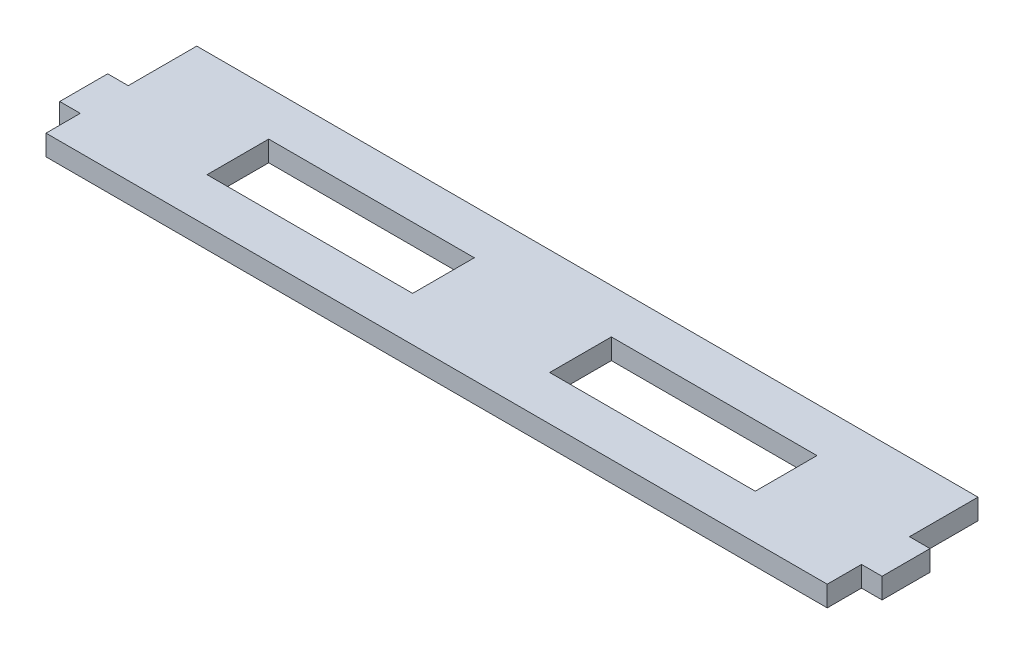
ISO-10303-21;
HEADER;
FILE_DESCRIPTION(('STEP AP214'),'2;1');
FILE_NAME('part.step','',(''),(''),'','','');
FILE_SCHEMA(('AUTOMOTIVE_DESIGN { 1 0 10303 214 1 1 1 1 }'));
ENDSEC;
DATA;
#1=APPLICATION_CONTEXT('core data for automotive mechanical design processes');
#2=APPLICATION_PROTOCOL_DEFINITION('international standard','automotive_design',2000,#1);
#3=PRODUCT_CONTEXT('',#1,'mechanical');
#4=PRODUCT('Part','Part','',(#3));
#5=PRODUCT_RELATED_PRODUCT_CATEGORY('part','',(#4));
#6=PRODUCT_DEFINITION_FORMATION('','',#4);
#7=PRODUCT_DEFINITION_CONTEXT('part definition',#1,'design');
#8=PRODUCT_DEFINITION('design','',#6,#7);
#9=PRODUCT_DEFINITION_SHAPE('','',#8);
#10=(LENGTH_UNIT() NAMED_UNIT(*) SI_UNIT(.MILLI.,.METRE.));
#11=(NAMED_UNIT(*) PLANE_ANGLE_UNIT() SI_UNIT($,.RADIAN.));
#12=(NAMED_UNIT(*) SI_UNIT($,.STERADIAN.) SOLID_ANGLE_UNIT());
#13=UNCERTAINTY_MEASURE_WITH_UNIT(LENGTH_MEASURE(1.E-05),#10,'distance_accuracy_value','');
#14=(GEOMETRIC_REPRESENTATION_CONTEXT(3) GLOBAL_UNCERTAINTY_ASSIGNED_CONTEXT((#13)) GLOBAL_UNIT_ASSIGNED_CONTEXT((#10,
#11,#12)) REPRESENTATION_CONTEXT('',''));
#15=CARTESIAN_POINT('',(0.,0.,0.));
#16=DIRECTION('',(0.,0.,1.));
#17=DIRECTION('',(1.,0.,0.));
#18=AXIS2_PLACEMENT_3D('',#15,#16,#17);
#19=CARTESIAN_POINT('',(-57.,3.,6.00000000000001));
#20=DIRECTION('',(1.,0.,0.));
#21=DIRECTION('',(0.,0.,-1.));
#22=AXIS2_PLACEMENT_3D('',#19,#20,#21);
#23=PLANE('',#22);
#24=DIRECTION('',(0.,0.,1.));
#25=VECTOR('',#24,1.);
#26=CARTESIAN_POINT('',(-57.,0.,6.00000000000001));
#27=LINE('',#26,#25);
#28=CARTESIAN_POINT('',(-57.,0.,6.00000000000001));
#29=VERTEX_POINT('',#28);
#30=CARTESIAN_POINT('',(-57.,0.,11.));
#31=VERTEX_POINT('',#30);
#32=EDGE_CURVE('E207',#29,#31,#27,.T.);
#33=ORIENTED_EDGE('',*,*,#32,.T.);
#34=DIRECTION('',(0.,-1.,0.));
#35=VECTOR('',#34,1.);
#36=CARTESIAN_POINT('',(-57.,3.,11.));
#37=LINE('',#36,#35);
#38=CARTESIAN_POINT('',(-57.,3.,11.));
#39=VERTEX_POINT('',#38);
#40=EDGE_CURVE('E11',#39,#31,#37,.T.);
#41=ORIENTED_EDGE('',*,*,#40,.F.);
#42=DIRECTION('',(0.,0.,1.));
#43=VECTOR('',#42,1.);
#44=CARTESIAN_POINT('',(-57.,3.,6.00000000000001));
#45=LINE('',#44,#43);
#46=CARTESIAN_POINT('',(-57.,3.,6.00000000000001));
#47=VERTEX_POINT('',#46);
#48=EDGE_CURVE('E240',#47,#39,#45,.T.);
#49=ORIENTED_EDGE('',*,*,#48,.F.);
#50=DIRECTION('',(0.,-1.,0.));
#51=VECTOR('',#50,1.);
#52=CARTESIAN_POINT('',(-57.,3.,6.00000000000001));
#53=LINE('',#52,#51);
#54=EDGE_CURVE('E266',#47,#29,#53,.T.);
#55=ORIENTED_EDGE('',*,*,#54,.T.);
#56=EDGE_LOOP('',(#33,#41,#49,#55));
#57=FACE_BOUND('',#56,.T.);
#58=ADVANCED_FACE('F34',(#57),#23,.F.);
#59=CARTESIAN_POINT('',(57.,3.,11.));
#60=DIRECTION('',(0.,0.,-1.));
#61=DIRECTION('',(-1.,0.,0.));
#62=AXIS2_PLACEMENT_3D('',#59,#60,#61);
#63=PLANE('',#62);
#64=DIRECTION('',(1.,0.,0.));
#65=VECTOR('',#64,1.);
#66=CARTESIAN_POINT('',(57.,0.,11.));
#67=LINE('',#66,#65);
#68=CARTESIAN_POINT('',(57.,0.,11.));
#69=VERTEX_POINT('',#68);
#70=EDGE_CURVE('E269',#31,#69,#67,.T.);
#71=ORIENTED_EDGE('',*,*,#70,.T.);
#72=DIRECTION('',(0.,-1.,0.));
#73=VECTOR('',#72,1.);
#74=CARTESIAN_POINT('',(57.,3.,11.));
#75=LINE('',#74,#73);
#76=CARTESIAN_POINT('',(57.,3.,11.));
#77=VERTEX_POINT('',#76);
#78=EDGE_CURVE('E41',#77,#69,#75,.T.);
#79=ORIENTED_EDGE('',*,*,#78,.F.);
#80=DIRECTION('',(1.,0.,0.));
#81=VECTOR('',#80,1.);
#82=CARTESIAN_POINT('',(57.,3.,11.));
#83=LINE('',#82,#81);
#84=EDGE_CURVE('E243',#39,#77,#83,.T.);
#85=ORIENTED_EDGE('',*,*,#84,.F.);
#86=ORIENTED_EDGE('',*,*,#40,.T.);
#87=EDGE_LOOP('',(#71,#79,#85,#86));
#88=FACE_BOUND('',#87,.T.);
#89=ADVANCED_FACE('F345',(#88),#63,.F.);
#90=CARTESIAN_POINT('',(57.,3.,5.99999999999999));
#91=DIRECTION('',(-1.,0.,0.));
#92=DIRECTION('',(0.,0.,1.));
#93=AXIS2_PLACEMENT_3D('',#90,#91,#92);
#94=PLANE('',#93);
#95=DIRECTION('',(0.,0.,-1.));
#96=VECTOR('',#95,1.);
#97=CARTESIAN_POINT('',(57.,0.,5.99999999999999));
#98=LINE('',#97,#96);
#99=CARTESIAN_POINT('',(57.,0.,5.99999999999999));
#100=VERTEX_POINT('',#99);
#101=EDGE_CURVE('E271',#69,#100,#98,.T.);
#102=ORIENTED_EDGE('',*,*,#101,.T.);
#103=DIRECTION('',(0.,-1.,0.));
#104=VECTOR('',#103,1.);
#105=CARTESIAN_POINT('',(57.,3.,5.99999999999999));
#106=LINE('',#105,#104);
#107=CARTESIAN_POINT('',(57.,3.,5.99999999999999));
#108=VERTEX_POINT('',#107);
#109=EDGE_CURVE('E316',#108,#100,#106,.T.);
#110=ORIENTED_EDGE('',*,*,#109,.F.);
#111=DIRECTION('',(0.,0.,-1.));
#112=VECTOR('',#111,1.);
#113=CARTESIAN_POINT('',(57.,3.,5.99999999999999));
#114=LINE('',#113,#112);
#115=EDGE_CURVE('E246',#77,#108,#114,.T.);
#116=ORIENTED_EDGE('',*,*,#115,.F.);
#117=ORIENTED_EDGE('',*,*,#78,.T.);
#118=EDGE_LOOP('',(#102,#110,#116,#117));
#119=FACE_BOUND('',#118,.T.);
#120=ADVANCED_FACE('F323',(#119),#94,.F.);
#121=CARTESIAN_POINT('',(60.,3.,5.99999999999999));
#122=DIRECTION('',(0.,0.,-1.));
#123=DIRECTION('',(-1.,0.,0.));
#124=AXIS2_PLACEMENT_3D('',#121,#122,#123);
#125=PLANE('',#124);
#126=DIRECTION('',(1.,0.,0.));
#127=VECTOR('',#126,1.);
#128=CARTESIAN_POINT('',(60.,0.,5.99999999999999));
#129=LINE('',#128,#127);
#130=CARTESIAN_POINT('',(60.,0.,5.99999999999999));
#131=VERTEX_POINT('',#130);
#132=EDGE_CURVE('E273',#100,#131,#129,.T.);
#133=ORIENTED_EDGE('',*,*,#132,.T.);
#134=DIRECTION('',(0.,-1.,0.));
#135=VECTOR('',#134,1.);
#136=CARTESIAN_POINT('',(60.,3.,5.99999999999999));
#137=LINE('',#136,#135);
#138=CARTESIAN_POINT('',(60.,3.,5.99999999999999));
#139=VERTEX_POINT('',#138);
#140=EDGE_CURVE('E313',#139,#131,#137,.T.);
#141=ORIENTED_EDGE('',*,*,#140,.F.);
#142=DIRECTION('',(1.,0.,0.));
#143=VECTOR('',#142,1.);
#144=CARTESIAN_POINT('',(60.,3.,5.99999999999999));
#145=LINE('',#144,#143);
#146=EDGE_CURVE('E248',#108,#139,#145,.T.);
#147=ORIENTED_EDGE('',*,*,#146,.F.);
#148=ORIENTED_EDGE('',*,*,#109,.T.);
#149=EDGE_LOOP('',(#133,#141,#147,#148));
#150=FACE_BOUND('',#149,.T.);
#151=ADVANCED_FACE('F333',(#150),#125,.F.);
#152=CARTESIAN_POINT('',(60.,3.,-1.00000000000001));
#153=DIRECTION('',(-1.,0.,0.));
#154=DIRECTION('',(0.,0.,1.));
#155=AXIS2_PLACEMENT_3D('',#152,#153,#154);
#156=PLANE('',#155);
#157=DIRECTION('',(0.,0.,-1.));
#158=VECTOR('',#157,1.);
#159=CARTESIAN_POINT('',(60.,0.,-1.00000000000001));
#160=LINE('',#159,#158);
#161=CARTESIAN_POINT('',(60.,0.,-1.00000000000001));
#162=VERTEX_POINT('',#161);
#163=EDGE_CURVE('E275',#131,#162,#160,.T.);
#164=ORIENTED_EDGE('',*,*,#163,.T.);
#165=DIRECTION('',(0.,-1.,0.));
#166=VECTOR('',#165,1.);
#167=CARTESIAN_POINT('',(60.,3.,-1.00000000000001));
#168=LINE('',#167,#166);
#169=CARTESIAN_POINT('',(60.,3.,-1.00000000000001));
#170=VERTEX_POINT('',#169);
#171=EDGE_CURVE('E310',#170,#162,#168,.T.);
#172=ORIENTED_EDGE('',*,*,#171,.F.);
#173=DIRECTION('',(0.,0.,-1.));
#174=VECTOR('',#173,1.);
#175=CARTESIAN_POINT('',(60.,3.,-1.00000000000001));
#176=LINE('',#175,#174);
#177=EDGE_CURVE('E250',#139,#170,#176,.T.);
#178=ORIENTED_EDGE('',*,*,#177,.F.);
#179=ORIENTED_EDGE('',*,*,#140,.T.);
#180=EDGE_LOOP('',(#164,#172,#178,#179));
#181=FACE_BOUND('',#180,.T.);
#182=ADVANCED_FACE('F337',(#181),#156,.F.);
#183=CARTESIAN_POINT('',(57.,3.,-1.00000000000001));
#184=DIRECTION('',(0.,0.,1.));
#185=DIRECTION('',(1.,0.,0.));
#186=AXIS2_PLACEMENT_3D('',#183,#184,#185);
#187=PLANE('',#186);
#188=DIRECTION('',(-1.,0.,0.));
#189=VECTOR('',#188,1.);
#190=CARTESIAN_POINT('',(57.,0.,-1.00000000000001));
#191=LINE('',#190,#189);
#192=CARTESIAN_POINT('',(57.,0.,-1.00000000000001));
#193=VERTEX_POINT('',#192);
#194=EDGE_CURVE('E277',#162,#193,#191,.T.);
#195=ORIENTED_EDGE('',*,*,#194,.T.);
#196=DIRECTION('',(0.,-1.,0.));
#197=VECTOR('',#196,1.);
#198=CARTESIAN_POINT('',(57.,3.,-1.00000000000001));
#199=LINE('',#198,#197);
#200=CARTESIAN_POINT('',(57.,3.,-1.00000000000001));
#201=VERTEX_POINT('',#200);
#202=EDGE_CURVE('E307',#201,#193,#199,.T.);
#203=ORIENTED_EDGE('',*,*,#202,.F.);
#204=DIRECTION('',(-1.,0.,0.));
#205=VECTOR('',#204,1.);
#206=CARTESIAN_POINT('',(57.,3.,-1.00000000000001));
#207=LINE('',#206,#205);
#208=EDGE_CURVE('E252',#170,#201,#207,.T.);
#209=ORIENTED_EDGE('',*,*,#208,.F.);
#210=ORIENTED_EDGE('',*,*,#171,.T.);
#211=EDGE_LOOP('',(#195,#203,#209,#210));
#212=FACE_BOUND('',#211,.T.);
#213=ADVANCED_FACE('F378',(#212),#187,.F.);
#214=CARTESIAN_POINT('',(57.,3.,-11.));
#215=DIRECTION('',(-1.,0.,0.));
#216=DIRECTION('',(0.,0.,1.));
#217=AXIS2_PLACEMENT_3D('',#214,#215,#216);
#218=PLANE('',#217);
#219=DIRECTION('',(0.,0.,-1.));
#220=VECTOR('',#219,1.);
#221=CARTESIAN_POINT('',(57.,0.,-11.));
#222=LINE('',#221,#220);
#223=CARTESIAN_POINT('',(57.,0.,-11.));
#224=VERTEX_POINT('',#223);
#225=EDGE_CURVE('E279',#193,#224,#222,.T.);
#226=ORIENTED_EDGE('',*,*,#225,.T.);
#227=DIRECTION('',(0.,-1.,0.));
#228=VECTOR('',#227,1.);
#229=CARTESIAN_POINT('',(57.,3.,-11.));
#230=LINE('',#229,#228);
#231=CARTESIAN_POINT('',(57.,3.,-11.));
#232=VERTEX_POINT('',#231);
#233=EDGE_CURVE('E304',#232,#224,#230,.T.);
#234=ORIENTED_EDGE('',*,*,#233,.F.);
#235=DIRECTION('',(0.,0.,-1.));
#236=VECTOR('',#235,1.);
#237=CARTESIAN_POINT('',(57.,3.,-11.));
#238=LINE('',#237,#236);
#239=EDGE_CURVE('E254',#201,#232,#238,.T.);
#240=ORIENTED_EDGE('',*,*,#239,.F.);
#241=ORIENTED_EDGE('',*,*,#202,.T.);
#242=EDGE_LOOP('',(#226,#234,#240,#241));
#243=FACE_BOUND('',#242,.T.);
#244=ADVANCED_FACE('F376',(#243),#218,.F.);
#245=CARTESIAN_POINT('',(57.,3.,-11.));
#246=DIRECTION('',(0.,0.,1.));
#247=DIRECTION('',(1.,0.,0.));
#248=AXIS2_PLACEMENT_3D('',#245,#246,#247);
#249=PLANE('',#248);
#250=DIRECTION('',(-1.,0.,0.));
#251=VECTOR('',#250,1.);
#252=CARTESIAN_POINT('',(57.,0.,-11.));
#253=LINE('',#252,#251);
#254=CARTESIAN_POINT('',(-57.,0.,-11.));
#255=VERTEX_POINT('',#254);
#256=EDGE_CURVE('E281',#224,#255,#253,.T.);
#257=ORIENTED_EDGE('',*,*,#256,.T.);
#258=DIRECTION('',(0.,-1.,0.));
#259=VECTOR('',#258,1.);
#260=CARTESIAN_POINT('',(-57.,3.,-11.));
#261=LINE('',#260,#259);
#262=CARTESIAN_POINT('',(-57.,3.,-11.));
#263=VERTEX_POINT('',#262);
#264=EDGE_CURVE('E301',#263,#255,#261,.T.);
#265=ORIENTED_EDGE('',*,*,#264,.F.);
#266=DIRECTION('',(-1.,0.,0.));
#267=VECTOR('',#266,1.);
#268=CARTESIAN_POINT('',(57.,3.,-11.));
#269=LINE('',#268,#267);
#270=EDGE_CURVE('E256',#232,#263,#269,.T.);
#271=ORIENTED_EDGE('',*,*,#270,.F.);
#272=ORIENTED_EDGE('',*,*,#233,.T.);
#273=EDGE_LOOP('',(#257,#265,#271,#272));
#274=FACE_BOUND('',#273,.T.);
#275=ADVANCED_FACE('F372',(#274),#249,.F.);
#276=CARTESIAN_POINT('',(-57.,3.,-11.));
#277=DIRECTION('',(1.,0.,0.));
#278=DIRECTION('',(0.,0.,-1.));
#279=AXIS2_PLACEMENT_3D('',#276,#277,#278);
#280=PLANE('',#279);
#281=DIRECTION('',(0.,0.,1.));
#282=VECTOR('',#281,1.);
#283=CARTESIAN_POINT('',(-57.,0.,-11.));
#284=LINE('',#283,#282);
#285=CARTESIAN_POINT('',(-57.,0.,-0.999999999999992));
#286=VERTEX_POINT('',#285);
#287=EDGE_CURVE('E283',#255,#286,#284,.T.);
#288=ORIENTED_EDGE('',*,*,#287,.T.);
#289=DIRECTION('',(0.,-1.,0.));
#290=VECTOR('',#289,1.);
#291=CARTESIAN_POINT('',(-57.,3.,-0.999999999999992));
#292=LINE('',#291,#290);
#293=CARTESIAN_POINT('',(-57.,3.,-0.999999999999992));
#294=VERTEX_POINT('',#293);
#295=EDGE_CURVE('E298',#294,#286,#292,.T.);
#296=ORIENTED_EDGE('',*,*,#295,.F.);
#297=DIRECTION('',(0.,0.,1.));
#298=VECTOR('',#297,1.);
#299=CARTESIAN_POINT('',(-57.,3.,-11.));
#300=LINE('',#299,#298);
#301=EDGE_CURVE('E258',#263,#294,#300,.T.);
#302=ORIENTED_EDGE('',*,*,#301,.F.);
#303=ORIENTED_EDGE('',*,*,#264,.T.);
#304=EDGE_LOOP('',(#288,#296,#302,#303));
#305=FACE_BOUND('',#304,.T.);
#306=ADVANCED_FACE('F367',(#305),#280,.F.);
#307=CARTESIAN_POINT('',(-57.,3.,-0.999999999999992));
#308=DIRECTION('',(0.,0.,1.));
#309=DIRECTION('',(1.,0.,0.));
#310=AXIS2_PLACEMENT_3D('',#307,#308,#309);
#311=PLANE('',#310);
#312=DIRECTION('',(-1.,0.,0.));
#313=VECTOR('',#312,1.);
#314=CARTESIAN_POINT('',(-57.,0.,-0.999999999999992));
#315=LINE('',#314,#313);
#316=CARTESIAN_POINT('',(-60.,0.,-0.999999999999992));
#317=VERTEX_POINT('',#316);
#318=EDGE_CURVE('E285',#286,#317,#315,.T.);
#319=ORIENTED_EDGE('',*,*,#318,.T.);
#320=DIRECTION('',(0.,-1.,0.));
#321=VECTOR('',#320,1.);
#322=CARTESIAN_POINT('',(-60.,3.,-0.999999999999992));
#323=LINE('',#322,#321);
#324=CARTESIAN_POINT('',(-60.,3.,-0.999999999999992));
#325=VERTEX_POINT('',#324);
#326=EDGE_CURVE('E295',#325,#317,#323,.T.);
#327=ORIENTED_EDGE('',*,*,#326,.F.);
#328=DIRECTION('',(-1.,0.,0.));
#329=VECTOR('',#328,1.);
#330=CARTESIAN_POINT('',(-57.,3.,-0.999999999999992));
#331=LINE('',#330,#329);
#332=EDGE_CURVE('E260',#294,#325,#331,.T.);
#333=ORIENTED_EDGE('',*,*,#332,.F.);
#334=ORIENTED_EDGE('',*,*,#295,.T.);
#335=EDGE_LOOP('',(#319,#327,#333,#334));
#336=FACE_BOUND('',#335,.T.);
#337=ADVANCED_FACE('F361',(#336),#311,.F.);
#338=CARTESIAN_POINT('',(-60.,3.,-0.999999999999992));
#339=DIRECTION('',(1.,0.,0.));
#340=DIRECTION('',(0.,0.,-1.));
#341=AXIS2_PLACEMENT_3D('',#338,#339,#340);
#342=PLANE('',#341);
#343=DIRECTION('',(0.,0.,1.));
#344=VECTOR('',#343,1.);
#345=CARTESIAN_POINT('',(-60.,0.,-0.999999999999992));
#346=LINE('',#345,#344);
#347=CARTESIAN_POINT('',(-60.,0.,6.00000000000001));
#348=VERTEX_POINT('',#347);
#349=EDGE_CURVE('E287',#317,#348,#346,.T.);
#350=ORIENTED_EDGE('',*,*,#349,.T.);
#351=DIRECTION('',(0.,-1.,0.));
#352=VECTOR('',#351,1.);
#353=CARTESIAN_POINT('',(-60.,3.,6.00000000000001));
#354=LINE('',#353,#352);
#355=CARTESIAN_POINT('',(-60.,3.,6.00000000000001));
#356=VERTEX_POINT('',#355);
#357=EDGE_CURVE('E292',#356,#348,#354,.T.);
#358=ORIENTED_EDGE('',*,*,#357,.F.);
#359=DIRECTION('',(0.,0.,1.));
#360=VECTOR('',#359,1.);
#361=CARTESIAN_POINT('',(-60.,3.,-0.999999999999992));
#362=LINE('',#361,#360);
#363=EDGE_CURVE('E262',#325,#356,#362,.T.);
#364=ORIENTED_EDGE('',*,*,#363,.F.);
#365=ORIENTED_EDGE('',*,*,#326,.T.);
#366=EDGE_LOOP('',(#350,#358,#364,#365));
#367=FACE_BOUND('',#366,.T.);
#368=ADVANCED_FACE('F357',(#367),#342,.F.);
#369=CARTESIAN_POINT('',(-60.,3.,6.00000000000001));
#370=DIRECTION('',(0.,0.,-1.));
#371=DIRECTION('',(-1.,0.,0.));
#372=AXIS2_PLACEMENT_3D('',#369,#370,#371);
#373=PLANE('',#372);
#374=DIRECTION('',(1.,0.,0.));
#375=VECTOR('',#374,1.);
#376=CARTESIAN_POINT('',(-60.,0.,6.00000000000001));
#377=LINE('',#376,#375);
#378=EDGE_CURVE('E244',#348,#29,#377,.T.);
#379=ORIENTED_EDGE('',*,*,#378,.T.);
#380=ORIENTED_EDGE('',*,*,#54,.F.);
#381=DIRECTION('',(1.,0.,0.));
#382=VECTOR('',#381,1.);
#383=CARTESIAN_POINT('',(-60.,3.,6.00000000000001));
#384=LINE('',#383,#382);
#385=EDGE_CURVE('E264',#356,#47,#384,.T.);
#386=ORIENTED_EDGE('',*,*,#385,.F.);
#387=ORIENTED_EDGE('',*,*,#357,.T.);
#388=EDGE_LOOP('',(#379,#380,#386,#387));
#389=FACE_BOUND('',#388,.T.);
#390=ADVANCED_FACE('F352',(#389),#373,.F.);
#391=CARTESIAN_POINT('',(0.,3.,0.));
#392=DIRECTION('',(0.,-1.,0.));
#393=DIRECTION('',(0.,0.,-1.));
#394=AXIS2_PLACEMENT_3D('',#391,#392,#393);
#395=PLANE('',#394);
#396=DIRECTION('',(1.,0.,0.));
#397=VECTOR('',#396,1.);
#398=CARTESIAN_POINT('',(-10.,3.,4.5));
#399=LINE('',#398,#397);
#400=CARTESIAN_POINT('',(-40.,3.,4.5));
#401=VERTEX_POINT('',#400);
#402=CARTESIAN_POINT('',(-10.,3.,4.5));
#403=VERTEX_POINT('',#402);
#404=EDGE_CURVE('E200',#401,#403,#399,.T.);
#405=ORIENTED_EDGE('',*,*,#404,.F.);
#406=DIRECTION('',(0.,0.,1.));
#407=VECTOR('',#406,1.);
#408=CARTESIAN_POINT('',(-40.,3.,4.5));
#409=LINE('',#408,#407);
#410=CARTESIAN_POINT('',(-40.,3.,-4.5));
#411=VERTEX_POINT('',#410);
#412=EDGE_CURVE('E48',#411,#401,#409,.T.);
#413=ORIENTED_EDGE('',*,*,#412,.F.);
#414=DIRECTION('',(-1.,0.,0.));
#415=VECTOR('',#414,1.);
#416=CARTESIAN_POINT('',(-10.,3.,-4.5));
#417=LINE('',#416,#415);
#418=CARTESIAN_POINT('',(-10.,3.,-4.5));
#419=VERTEX_POINT('',#418);
#420=EDGE_CURVE('E191',#419,#411,#417,.T.);
#421=ORIENTED_EDGE('',*,*,#420,.F.);
#422=DIRECTION('',(0.,0.,-1.));
#423=VECTOR('',#422,1.);
#424=CARTESIAN_POINT('',(-10.,3.,4.5));
#425=LINE('',#424,#423);
#426=EDGE_CURVE('E194',#403,#419,#425,.T.);
#427=ORIENTED_EDGE('',*,*,#426,.F.);
#428=EDGE_LOOP('',(#405,#413,#421,#427));
#429=FACE_BOUND('',#428,.T.);
#430=DIRECTION('',(1.,0.,0.));
#431=VECTOR('',#430,1.);
#432=CARTESIAN_POINT('',(40.,3.,4.5));
#433=LINE('',#432,#431);
#434=CARTESIAN_POINT('',(10.,3.,4.5));
#435=VERTEX_POINT('',#434);
#436=CARTESIAN_POINT('',(40.,3.,4.5));
#437=VERTEX_POINT('',#436);
#438=EDGE_CURVE('E226',#435,#437,#433,.T.);
#439=ORIENTED_EDGE('',*,*,#438,.F.);
#440=DIRECTION('',(0.,0.,1.));
#441=VECTOR('',#440,1.);
#442=CARTESIAN_POINT('',(10.,3.,4.5));
#443=LINE('',#442,#441);
#444=CARTESIAN_POINT('',(10.,3.,-4.5));
#445=VERTEX_POINT('',#444);
#446=EDGE_CURVE('E56',#445,#435,#443,.T.);
#447=ORIENTED_EDGE('',*,*,#446,.F.);
#448=DIRECTION('',(-1.,0.,0.));
#449=VECTOR('',#448,1.);
#450=CARTESIAN_POINT('',(40.,3.,-4.5));
#451=LINE('',#450,#449);
#452=CARTESIAN_POINT('',(40.,3.,-4.5));
#453=VERTEX_POINT('',#452);
#454=EDGE_CURVE('E215',#453,#445,#451,.T.);
#455=ORIENTED_EDGE('',*,*,#454,.F.);
#456=DIRECTION('',(0.,0.,-1.));
#457=VECTOR('',#456,1.);
#458=CARTESIAN_POINT('',(40.,3.,4.5));
#459=LINE('',#458,#457);
#460=EDGE_CURVE('E229',#437,#453,#459,.T.);
#461=ORIENTED_EDGE('',*,*,#460,.F.);
#462=EDGE_LOOP('',(#439,#447,#455,#461));
#463=FACE_BOUND('',#462,.T.);
#464=ORIENTED_EDGE('',*,*,#48,.T.);
#465=ORIENTED_EDGE('',*,*,#84,.T.);
#466=ORIENTED_EDGE('',*,*,#115,.T.);
#467=ORIENTED_EDGE('',*,*,#146,.T.);
#468=ORIENTED_EDGE('',*,*,#177,.T.);
#469=ORIENTED_EDGE('',*,*,#208,.T.);
#470=ORIENTED_EDGE('',*,*,#239,.T.);
#471=ORIENTED_EDGE('',*,*,#270,.T.);
#472=ORIENTED_EDGE('',*,*,#301,.T.);
#473=ORIENTED_EDGE('',*,*,#332,.T.);
#474=ORIENTED_EDGE('',*,*,#363,.T.);
#475=ORIENTED_EDGE('',*,*,#385,.T.);
#476=EDGE_LOOP('',(#464,#465,#466,#467,#468,#469,#470,#471,#472,#473,#474,#475));
#477=FACE_BOUND('',#476,.T.);
#478=ADVANCED_FACE('F341',(#429,#463,#477),#395,.F.);
#479=CARTESIAN_POINT('',(0.,0.,0.));
#480=DIRECTION('',(0.,-1.,0.));
#481=DIRECTION('',(0.,0.,-1.));
#482=AXIS2_PLACEMENT_3D('',#479,#480,#481);
#483=PLANE('',#482);
#484=DIRECTION('',(0.,0.,1.));
#485=VECTOR('',#484,1.);
#486=CARTESIAN_POINT('',(-40.,0.,4.5));
#487=LINE('',#486,#485);
#488=CARTESIAN_POINT('',(-40.,0.,-4.5));
#489=VERTEX_POINT('',#488);
#490=CARTESIAN_POINT('',(-40.,0.,4.5));
#491=VERTEX_POINT('',#490);
#492=EDGE_CURVE('E172',#489,#491,#487,.T.);
#493=ORIENTED_EDGE('',*,*,#492,.T.);
#494=DIRECTION('',(1.,0.,0.));
#495=VECTOR('',#494,1.);
#496=CARTESIAN_POINT('',(-10.,0.,4.5));
#497=LINE('',#496,#495);
#498=CARTESIAN_POINT('',(-10.,0.,4.5));
#499=VERTEX_POINT('',#498);
#500=EDGE_CURVE('E182',#491,#499,#497,.T.);
#501=ORIENTED_EDGE('',*,*,#500,.T.);
#502=DIRECTION('',(0.,0.,-1.));
#503=VECTOR('',#502,1.);
#504=CARTESIAN_POINT('',(-10.,0.,4.5));
#505=LINE('',#504,#503);
#506=CARTESIAN_POINT('',(-10.,0.,-4.5));
#507=VERTEX_POINT('',#506);
#508=EDGE_CURVE('E186',#499,#507,#505,.T.);
#509=ORIENTED_EDGE('',*,*,#508,.T.);
#510=DIRECTION('',(-1.,0.,0.));
#511=VECTOR('',#510,1.);
#512=CARTESIAN_POINT('',(-10.,0.,-4.5));
#513=LINE('',#512,#511);
#514=EDGE_CURVE('E178',#507,#489,#513,.T.);
#515=ORIENTED_EDGE('',*,*,#514,.T.);
#516=EDGE_LOOP('',(#493,#501,#509,#515));
#517=FACE_BOUND('',#516,.T.);
#518=DIRECTION('',(0.,0.,1.));
#519=VECTOR('',#518,1.);
#520=CARTESIAN_POINT('',(10.,0.,4.5));
#521=LINE('',#520,#519);
#522=CARTESIAN_POINT('',(10.,0.,-4.5));
#523=VERTEX_POINT('',#522);
#524=CARTESIAN_POINT('',(10.,0.,4.5));
#525=VERTEX_POINT('',#524);
#526=EDGE_CURVE('E211',#523,#525,#521,.T.);
#527=ORIENTED_EDGE('',*,*,#526,.T.);
#528=DIRECTION('',(1.,0.,0.));
#529=VECTOR('',#528,1.);
#530=CARTESIAN_POINT('',(40.,0.,4.5));
#531=LINE('',#530,#529);
#532=CARTESIAN_POINT('',(40.,0.,4.5));
#533=VERTEX_POINT('',#532);
#534=EDGE_CURVE('E214',#525,#533,#531,.T.);
#535=ORIENTED_EDGE('',*,*,#534,.T.);
#536=DIRECTION('',(0.,0.,-1.));
#537=VECTOR('',#536,1.);
#538=CARTESIAN_POINT('',(40.,0.,4.5));
#539=LINE('',#538,#537);
#540=CARTESIAN_POINT('',(40.,0.,-4.5));
#541=VERTEX_POINT('',#540);
#542=EDGE_CURVE('E218',#533,#541,#539,.T.);
#543=ORIENTED_EDGE('',*,*,#542,.T.);
#544=DIRECTION('',(-1.,0.,0.));
#545=VECTOR('',#544,1.);
#546=CARTESIAN_POINT('',(40.,0.,-4.5));
#547=LINE('',#546,#545);
#548=EDGE_CURVE('E221',#541,#523,#547,.T.);
#549=ORIENTED_EDGE('',*,*,#548,.T.);
#550=EDGE_LOOP('',(#527,#535,#543,#549));
#551=FACE_BOUND('',#550,.T.);
#552=ORIENTED_EDGE('',*,*,#32,.F.);
#553=ORIENTED_EDGE('',*,*,#378,.F.);
#554=ORIENTED_EDGE('',*,*,#349,.F.);
#555=ORIENTED_EDGE('',*,*,#318,.F.);
#556=ORIENTED_EDGE('',*,*,#287,.F.);
#557=ORIENTED_EDGE('',*,*,#256,.F.);
#558=ORIENTED_EDGE('',*,*,#225,.F.);
#559=ORIENTED_EDGE('',*,*,#194,.F.);
#560=ORIENTED_EDGE('',*,*,#163,.F.);
#561=ORIENTED_EDGE('',*,*,#132,.F.);
#562=ORIENTED_EDGE('',*,*,#101,.F.);
#563=ORIENTED_EDGE('',*,*,#70,.F.);
#564=EDGE_LOOP('',(#552,#553,#554,#555,#556,#557,#558,#559,#560,#561,#562,#563));
#565=FACE_BOUND('',#564,.T.);
#566=ADVANCED_FACE('F188',(#517,#551,#565),#483,.T.);
#567=CARTESIAN_POINT('',(10.,0.,4.5));
#568=DIRECTION('',(-1.,0.,0.));
#569=DIRECTION('',(0.,0.,1.));
#570=AXIS2_PLACEMENT_3D('',#567,#568,#569);
#571=PLANE('',#570);
#572=ORIENTED_EDGE('',*,*,#446,.T.);
#573=DIRECTION('',(0.,1.,0.));
#574=VECTOR('',#573,1.);
#575=CARTESIAN_POINT('',(10.,0.,4.5));
#576=LINE('',#575,#574);
#577=EDGE_CURVE('E224',#525,#435,#576,.T.);
#578=ORIENTED_EDGE('',*,*,#577,.F.);
#579=ORIENTED_EDGE('',*,*,#526,.F.);
#580=DIRECTION('',(0.,1.,0.));
#581=VECTOR('',#580,1.);
#582=CARTESIAN_POINT('',(10.,0.,-4.5));
#583=LINE('',#582,#581);
#584=EDGE_CURVE('E201',#523,#445,#583,.T.);
#585=ORIENTED_EDGE('',*,*,#584,.T.);
#586=EDGE_LOOP('',(#572,#578,#579,#585));
#587=FACE_BOUND('',#586,.T.);
#588=ADVANCED_FACE('F470',(#587),#571,.F.);
#589=CARTESIAN_POINT('',(40.,0.,-4.5));
#590=DIRECTION('',(0.,0.,-1.));
#591=DIRECTION('',(-1.,0.,0.));
#592=AXIS2_PLACEMENT_3D('',#589,#590,#591);
#593=PLANE('',#592);
#594=ORIENTED_EDGE('',*,*,#454,.T.);
#595=ORIENTED_EDGE('',*,*,#584,.F.);
#596=ORIENTED_EDGE('',*,*,#548,.F.);
#597=DIRECTION('',(0.,1.,0.));
#598=VECTOR('',#597,1.);
#599=CARTESIAN_POINT('',(40.,0.,-4.5));
#600=LINE('',#599,#598);
#601=EDGE_CURVE('E235',#541,#453,#600,.T.);
#602=ORIENTED_EDGE('',*,*,#601,.T.);
#603=EDGE_LOOP('',(#594,#595,#596,#602));
#604=FACE_BOUND('',#603,.T.);
#605=ADVANCED_FACE('F478',(#604),#593,.F.);
#606=CARTESIAN_POINT('',(40.,0.,4.5));
#607=DIRECTION('',(1.,0.,0.));
#608=DIRECTION('',(0.,0.,-1.));
#609=AXIS2_PLACEMENT_3D('',#606,#607,#608);
#610=PLANE('',#609);
#611=ORIENTED_EDGE('',*,*,#460,.T.);
#612=ORIENTED_EDGE('',*,*,#601,.F.);
#613=ORIENTED_EDGE('',*,*,#542,.F.);
#614=DIRECTION('',(0.,1.,0.));
#615=VECTOR('',#614,1.);
#616=CARTESIAN_POINT('',(40.,0.,4.5));
#617=LINE('',#616,#615);
#618=EDGE_CURVE('E237',#533,#437,#617,.T.);
#619=ORIENTED_EDGE('',*,*,#618,.T.);
#620=EDGE_LOOP('',(#611,#612,#613,#619));
#621=FACE_BOUND('',#620,.T.);
#622=ADVANCED_FACE('F487',(#621),#610,.F.);
#623=CARTESIAN_POINT('',(40.,0.,4.5));
#624=DIRECTION('',(0.,0.,1.));
#625=DIRECTION('',(1.,0.,0.));
#626=AXIS2_PLACEMENT_3D('',#623,#624,#625);
#627=PLANE('',#626);
#628=ORIENTED_EDGE('',*,*,#438,.T.);
#629=ORIENTED_EDGE('',*,*,#618,.F.);
#630=ORIENTED_EDGE('',*,*,#534,.F.);
#631=ORIENTED_EDGE('',*,*,#577,.T.);
#632=EDGE_LOOP('',(#628,#629,#630,#631));
#633=FACE_BOUND('',#632,.T.);
#634=ADVANCED_FACE('F497',(#633),#627,.F.);
#635=CARTESIAN_POINT('',(-40.,0.,4.5));
#636=DIRECTION('',(-1.,0.,0.));
#637=DIRECTION('',(0.,0.,1.));
#638=AXIS2_PLACEMENT_3D('',#635,#636,#637);
#639=PLANE('',#638);
#640=ORIENTED_EDGE('',*,*,#412,.T.);
#641=DIRECTION('',(0.,1.,0.));
#642=VECTOR('',#641,1.);
#643=CARTESIAN_POINT('',(-40.,0.,4.5));
#644=LINE('',#643,#642);
#645=EDGE_CURVE('E168',#491,#401,#644,.T.);
#646=ORIENTED_EDGE('',*,*,#645,.F.);
#647=ORIENTED_EDGE('',*,*,#492,.F.);
#648=DIRECTION('',(0.,1.,0.));
#649=VECTOR('',#648,1.);
#650=CARTESIAN_POINT('',(-40.,0.,-4.5));
#651=LINE('',#650,#649);
#652=EDGE_CURVE('E205',#489,#411,#651,.T.);
#653=ORIENTED_EDGE('',*,*,#652,.T.);
#654=EDGE_LOOP('',(#640,#646,#647,#653));
#655=FACE_BOUND('',#654,.T.);
#656=ADVANCED_FACE('F170',(#655),#639,.F.);
#657=CARTESIAN_POINT('',(-10.,0.,-4.5));
#658=DIRECTION('',(0.,0.,-1.));
#659=DIRECTION('',(-1.,0.,0.));
#660=AXIS2_PLACEMENT_3D('',#657,#658,#659);
#661=PLANE('',#660);
#662=ORIENTED_EDGE('',*,*,#420,.T.);
#663=ORIENTED_EDGE('',*,*,#652,.F.);
#664=ORIENTED_EDGE('',*,*,#514,.F.);
#665=DIRECTION('',(0.,1.,0.));
#666=VECTOR('',#665,1.);
#667=CARTESIAN_POINT('',(-10.,0.,-4.5));
#668=LINE('',#667,#666);
#669=EDGE_CURVE('E208',#507,#419,#668,.T.);
#670=ORIENTED_EDGE('',*,*,#669,.T.);
#671=EDGE_LOOP('',(#662,#663,#664,#670));
#672=FACE_BOUND('',#671,.T.);
#673=ADVANCED_FACE('F516',(#672),#661,.F.);
#674=CARTESIAN_POINT('',(-10.,0.,4.5));
#675=DIRECTION('',(1.,0.,0.));
#676=DIRECTION('',(0.,0.,-1.));
#677=AXIS2_PLACEMENT_3D('',#674,#675,#676);
#678=PLANE('',#677);
#679=ORIENTED_EDGE('',*,*,#426,.T.);
#680=ORIENTED_EDGE('',*,*,#669,.F.);
#681=ORIENTED_EDGE('',*,*,#508,.F.);
#682=DIRECTION('',(0.,1.,0.));
#683=VECTOR('',#682,1.);
#684=CARTESIAN_POINT('',(-10.,0.,4.5));
#685=LINE('',#684,#683);
#686=EDGE_CURVE('E177',#499,#403,#685,.T.);
#687=ORIENTED_EDGE('',*,*,#686,.T.);
#688=EDGE_LOOP('',(#679,#680,#681,#687));
#689=FACE_BOUND('',#688,.T.);
#690=ADVANCED_FACE('F525',(#689),#678,.F.);
#691=CARTESIAN_POINT('',(-10.,0.,4.5));
#692=DIRECTION('',(0.,0.,1.));
#693=DIRECTION('',(1.,0.,0.));
#694=AXIS2_PLACEMENT_3D('',#691,#692,#693);
#695=PLANE('',#694);
#696=ORIENTED_EDGE('',*,*,#404,.T.);
#697=ORIENTED_EDGE('',*,*,#686,.F.);
#698=ORIENTED_EDGE('',*,*,#500,.F.);
#699=ORIENTED_EDGE('',*,*,#645,.T.);
#700=EDGE_LOOP('',(#696,#697,#698,#699));
#701=FACE_BOUND('',#700,.T.);
#702=ADVANCED_FACE('F183',(#701),#695,.F.);
#703=CLOSED_SHELL('',(#58,#89,#120,#151,#182,#213,#244,#275,#306,#337,#368,#390,#478,#566,#588,
#605,#622,#634,#656,#673,#690,#702));
#704=MANIFOLD_SOLID_BREP('B2',#703);
#705=ADVANCED_BREP_SHAPE_REPRESENTATION('',(#18,#704),#14);
#706=SHAPE_DEFINITION_REPRESENTATION(#9,#705);
ENDSEC;
END-ISO-10303-21;
